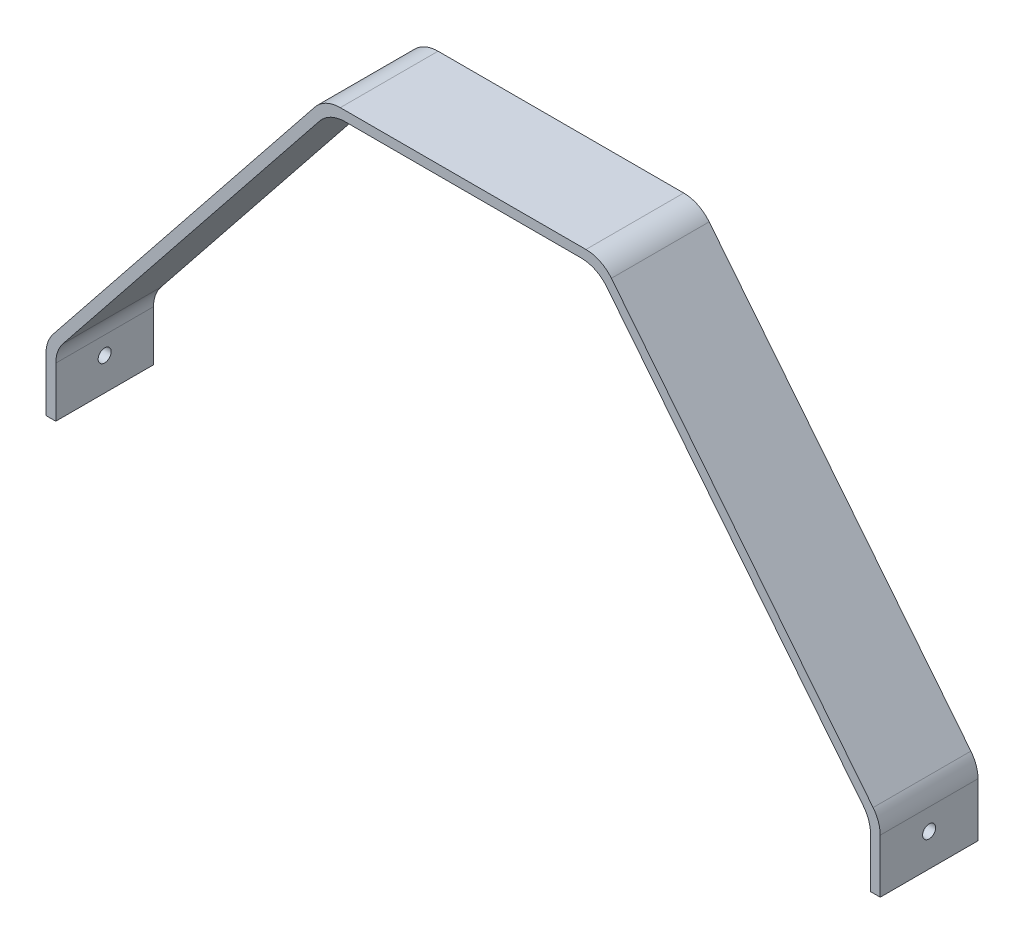
ISO-10303-21;
HEADER;
FILE_DESCRIPTION(('STEP AP214'),'2;1');
FILE_NAME('part.step','',(''),(''),'','','');
FILE_SCHEMA(('AUTOMOTIVE_DESIGN { 1 0 10303 214 1 1 1 1 }'));
ENDSEC;
DATA;
#1=APPLICATION_CONTEXT('core data for automotive mechanical design processes');
#2=APPLICATION_PROTOCOL_DEFINITION('international standard','automotive_design',2000,#1);
#3=PRODUCT_CONTEXT('',#1,'mechanical');
#4=PRODUCT('Part','Part','',(#3));
#5=PRODUCT_RELATED_PRODUCT_CATEGORY('part','',(#4));
#6=PRODUCT_DEFINITION_FORMATION('','',#4);
#7=PRODUCT_DEFINITION_CONTEXT('part definition',#1,'design');
#8=PRODUCT_DEFINITION('design','',#6,#7);
#9=PRODUCT_DEFINITION_SHAPE('','',#8);
#10=(LENGTH_UNIT() NAMED_UNIT(*) SI_UNIT(.MILLI.,.METRE.));
#11=(NAMED_UNIT(*) PLANE_ANGLE_UNIT() SI_UNIT($,.RADIAN.));
#12=(NAMED_UNIT(*) SI_UNIT($,.STERADIAN.) SOLID_ANGLE_UNIT());
#13=UNCERTAINTY_MEASURE_WITH_UNIT(LENGTH_MEASURE(1.E-05),#10,'distance_accuracy_value','');
#14=(GEOMETRIC_REPRESENTATION_CONTEXT(3) GLOBAL_UNCERTAINTY_ASSIGNED_CONTEXT((#13)) GLOBAL_UNIT_ASSIGNED_CONTEXT((#10,
#11,#12)) REPRESENTATION_CONTEXT('',''));
#15=CARTESIAN_POINT('',(0.,0.,0.));
#16=DIRECTION('',(0.,0.,1.));
#17=DIRECTION('',(1.,0.,0.));
#18=AXIS2_PLACEMENT_3D('',#15,#16,#17);
#19=CARTESIAN_POINT('',(0.,-127.,30.));
#20=DIRECTION('',(0.,-1.,0.));
#21=DIRECTION('',(0.,0.,-1.));
#22=AXIS2_PLACEMENT_3D('',#19,#20,#21);
#23=PLANE('',#22);
#24=DIRECTION('',(-1.,0.,0.));
#25=VECTOR('',#24,1.);
#26=CARTESIAN_POINT('',(0.,-127.,0.));
#27=LINE('',#26,#25);
#28=CARTESIAN_POINT('',(128.,-127.,0.));
#29=VERTEX_POINT('',#28);
#30=CARTESIAN_POINT('',(125.,-127.,0.));
#31=VERTEX_POINT('',#30);
#32=EDGE_CURVE('E191',#29,#31,#27,.T.);
#33=ORIENTED_EDGE('',*,*,#32,.F.);
#34=DIRECTION('',(0.,0.,-1.));
#35=VECTOR('',#34,1.);
#36=CARTESIAN_POINT('',(128.,-127.,30.));
#37=LINE('',#36,#35);
#38=CARTESIAN_POINT('',(128.,-127.,30.));
#39=VERTEX_POINT('',#38);
#40=EDGE_CURVE('E185',#39,#29,#37,.T.);
#41=ORIENTED_EDGE('',*,*,#40,.F.);
#42=DIRECTION('',(-1.,0.,0.));
#43=VECTOR('',#42,1.);
#44=CARTESIAN_POINT('',(0.,-127.,30.));
#45=LINE('',#44,#43);
#46=CARTESIAN_POINT('',(125.,-127.,30.));
#47=VERTEX_POINT('',#46);
#48=EDGE_CURVE('E188',#39,#47,#45,.T.);
#49=ORIENTED_EDGE('',*,*,#48,.T.);
#50=DIRECTION('',(0.,0.,-1.));
#51=VECTOR('',#50,1.);
#52=CARTESIAN_POINT('',(125.,-127.,30.));
#53=LINE('',#52,#51);
#54=EDGE_CURVE('E257',#47,#31,#53,.T.);
#55=ORIENTED_EDGE('',*,*,#54,.T.);
#56=EDGE_LOOP('',(#33,#41,#49,#55));
#57=FACE_BOUND('',#56,.T.);
#58=ADVANCED_FACE('F45',(#57),#23,.T.);
#59=CARTESIAN_POINT('',(128.,1.77635683940025E-13,30.));
#60=DIRECTION('',(-1.,0.,0.));
#61=DIRECTION('',(0.,-1.,0.));
#62=AXIS2_PLACEMENT_3D('',#59,#60,#61);
#63=PLANE('',#62);
#64=CARTESIAN_POINT('',(128.,-117.,15.));
#65=DIRECTION('',(1.,0.,0.));
#66=DIRECTION('',(0.,0.,-1.));
#67=AXIS2_PLACEMENT_3D('',#64,#65,#66);
#68=CIRCLE('',#67,2.);
#69=CARTESIAN_POINT('',(128.,-117.,13.));
#70=VERTEX_POINT('',#69);
#71=EDGE_CURVE('E530',#70,#70,#68,.T.);
#72=ORIENTED_EDGE('',*,*,#71,.F.);
#73=EDGE_LOOP('',(#72));
#74=FACE_BOUND('',#73,.T.);
#75=DIRECTION('',(0.,1.,0.));
#76=VECTOR('',#75,1.);
#77=CARTESIAN_POINT('',(128.,1.77635683940025E-13,0.));
#78=LINE('',#77,#76);
#79=CARTESIAN_POINT('',(128.,-110.504609524674,0.));
#80=VERTEX_POINT('',#79);
#81=EDGE_CURVE('E260',#29,#80,#78,.T.);
#82=ORIENTED_EDGE('',*,*,#81,.T.);
#83=DIRECTION('',(0.,0.,-1.));
#84=VECTOR('',#83,1.);
#85=CARTESIAN_POINT('',(128.,-110.504609524674,30.));
#86=LINE('',#85,#84);
#87=CARTESIAN_POINT('',(128.,-110.504609524674,30.));
#88=VERTEX_POINT('',#87);
#89=EDGE_CURVE('E203',#80,#88,#86,.F.);
#90=ORIENTED_EDGE('',*,*,#89,.T.);
#91=DIRECTION('',(0.,1.,0.));
#92=VECTOR('',#91,1.);
#93=CARTESIAN_POINT('',(128.,1.77635683940025E-13,30.));
#94=LINE('',#93,#92);
#95=EDGE_CURVE('E200',#39,#88,#94,.T.);
#96=ORIENTED_EDGE('',*,*,#95,.F.);
#97=ORIENTED_EDGE('',*,*,#40,.T.);
#98=EDGE_LOOP('',(#82,#90,#96,#97));
#99=FACE_BOUND('',#98,.T.);
#100=ADVANCED_FACE('F201',(#74,#99),#63,.F.);
#101=CARTESIAN_POINT('',(25.9382704532431,20.7263749883391,30.));
#102=DIRECTION('',(0.78122483700831,0.624249752936547,0.));
#103=DIRECTION('',(-0.624249752936547,0.78122483700831,0.));
#104=AXIS2_PLACEMENT_3D('',#101,#102,#103);
#105=PLANE('',#104);
#106=DIRECTION('',(0.624249752936547,-0.78122483700831,0.));
#107=VECTOR('',#106,1.);
#108=CARTESIAN_POINT('',(25.9382704532431,20.7263749883391,0.));
#109=LINE('',#108,#107);
#110=CARTESIAN_POINT('',(45.5024902919556,-3.75750247063452,0.));
#111=VERTEX_POINT('',#110);
#112=CARTESIAN_POINT('',(125.812248370083,-104.262111995309,0.));
#113=VERTEX_POINT('',#112);
#114=EDGE_CURVE('E263',#111,#113,#109,.T.);
#115=ORIENTED_EDGE('',*,*,#114,.F.);
#116=DIRECTION('',(0.,0.,-1.));
#117=VECTOR('',#116,1.);
#118=CARTESIAN_POINT('',(45.5024902919556,-3.75750247063452,30.));
#119=LINE('',#118,#117);
#120=CARTESIAN_POINT('',(45.5024902919556,-3.75750247063452,30.));
#121=VERTEX_POINT('',#120);
#122=EDGE_CURVE('E376',#111,#121,#119,.F.);
#123=ORIENTED_EDGE('',*,*,#122,.T.);
#124=DIRECTION('',(0.624249752936547,-0.78122483700831,0.));
#125=VECTOR('',#124,1.);
#126=CARTESIAN_POINT('',(25.9382704532431,20.7263749883391,30.));
#127=LINE('',#126,#125);
#128=CARTESIAN_POINT('',(125.812248370083,-104.262111995309,30.));
#129=VERTEX_POINT('',#128);
#130=EDGE_CURVE('E206',#121,#129,#127,.T.);
#131=ORIENTED_EDGE('',*,*,#130,.T.);
#132=DIRECTION('',(0.,0.,-1.));
#133=VECTOR('',#132,1.);
#134=CARTESIAN_POINT('',(125.812248370083,-104.262111995309,0.));
#135=LINE('',#134,#133);
#136=EDGE_CURVE('E372',#129,#113,#135,.T.);
#137=ORIENTED_EDGE('',*,*,#136,.T.);
#138=EDGE_LOOP('',(#115,#123,#131,#137));
#139=FACE_BOUND('',#138,.T.);
#140=ADVANCED_FACE('F428',(#139),#105,.T.);
#141=CARTESIAN_POINT('',(0.,0.,30.));
#142=DIRECTION('',(0.,1.,0.));
#143=DIRECTION('',(-1.,0.,0.));
#144=AXIS2_PLACEMENT_3D('',#141,#142,#143);
#145=PLANE('',#144);
#146=DIRECTION('',(1.,0.,0.));
#147=VECTOR('',#146,1.);
#148=CARTESIAN_POINT('',(0.,0.,0.));
#149=LINE('',#148,#147);
#150=CARTESIAN_POINT('',(-37.6902419218725,0.,0.));
#151=VERTEX_POINT('',#150);
#152=CARTESIAN_POINT('',(37.6902419218725,0.,0.));
#153=VERTEX_POINT('',#152);
#154=EDGE_CURVE('E267',#151,#153,#149,.T.);
#155=ORIENTED_EDGE('',*,*,#154,.F.);
#156=DIRECTION('',(0.,0.,-1.));
#157=VECTOR('',#156,1.);
#158=CARTESIAN_POINT('',(-37.6902419218725,0.,30.));
#159=LINE('',#158,#157);
#160=CARTESIAN_POINT('',(-37.6902419218725,0.,30.));
#161=VERTEX_POINT('',#160);
#162=EDGE_CURVE('E69',#151,#161,#159,.F.);
#163=ORIENTED_EDGE('',*,*,#162,.T.);
#164=DIRECTION('',(1.,0.,0.));
#165=VECTOR('',#164,1.);
#166=CARTESIAN_POINT('',(0.,0.,30.));
#167=LINE('',#166,#165);
#168=CARTESIAN_POINT('',(37.6902419218725,0.,30.));
#169=VERTEX_POINT('',#168);
#170=EDGE_CURVE('E226',#161,#169,#167,.T.);
#171=ORIENTED_EDGE('',*,*,#170,.T.);
#172=DIRECTION('',(0.,0.,-1.));
#173=VECTOR('',#172,1.);
#174=CARTESIAN_POINT('',(37.6902419218725,0.,30.));
#175=LINE('',#174,#173);
#176=EDGE_CURVE('E366',#169,#153,#175,.T.);
#177=ORIENTED_EDGE('',*,*,#176,.T.);
#178=EDGE_LOOP('',(#155,#163,#171,#177));
#179=FACE_BOUND('',#178,.T.);
#180=ADVANCED_FACE('F433',(#179),#145,.T.);
#181=CARTESIAN_POINT('',(-25.9382704532431,20.7263749883391,30.));
#182=DIRECTION('',(0.78122483700831,-0.624249752936546,0.));
#183=DIRECTION('',(0.624249752936546,0.78122483700831,0.));
#184=AXIS2_PLACEMENT_3D('',#181,#182,#183);
#185=PLANE('',#184);
#186=DIRECTION('',(-0.624249752936546,-0.78122483700831,0.));
#187=VECTOR('',#186,1.);
#188=CARTESIAN_POINT('',(-25.9382704532431,20.7263749883391,0.));
#189=LINE('',#188,#187);
#190=CARTESIAN_POINT('',(-45.5024902919556,-3.75750247063454,0.));
#191=VERTEX_POINT('',#190);
#192=CARTESIAN_POINT('',(-125.812248370083,-104.262111995309,0.));
#193=VERTEX_POINT('',#192);
#194=EDGE_CURVE('E271',#191,#193,#189,.T.);
#195=ORIENTED_EDGE('',*,*,#194,.T.);
#196=DIRECTION('',(0.,0.,-1.));
#197=VECTOR('',#196,1.);
#198=CARTESIAN_POINT('',(-125.812248370083,-104.262111995309,30.));
#199=LINE('',#198,#197);
#200=CARTESIAN_POINT('',(-125.812248370083,-104.262111995309,30.));
#201=VERTEX_POINT('',#200);
#202=EDGE_CURVE('E352',#193,#201,#199,.F.);
#203=ORIENTED_EDGE('',*,*,#202,.T.);
#204=DIRECTION('',(-0.624249752936546,-0.78122483700831,0.));
#205=VECTOR('',#204,1.);
#206=CARTESIAN_POINT('',(-25.9382704532431,20.7263749883391,30.));
#207=LINE('',#206,#205);
#208=CARTESIAN_POINT('',(-45.5024902919556,-3.75750247063454,30.));
#209=VERTEX_POINT('',#208);
#210=EDGE_CURVE('E229',#209,#201,#207,.T.);
#211=ORIENTED_EDGE('',*,*,#210,.F.);
#212=DIRECTION('',(0.,0.,-1.));
#213=VECTOR('',#212,1.);
#214=CARTESIAN_POINT('',(-45.5024902919556,-3.75750247063453,0.));
#215=LINE('',#214,#213);
#216=EDGE_CURVE('E348',#209,#191,#215,.T.);
#217=ORIENTED_EDGE('',*,*,#216,.T.);
#218=EDGE_LOOP('',(#195,#203,#211,#217));
#219=FACE_BOUND('',#218,.T.);
#220=ADVANCED_FACE('F441',(#219),#185,.F.);
#221=CARTESIAN_POINT('',(-128.,1.77635683940025E-13,30.));
#222=DIRECTION('',(-1.,0.,0.));
#223=DIRECTION('',(0.,-1.,0.));
#224=AXIS2_PLACEMENT_3D('',#221,#222,#223);
#225=PLANE('',#224);
#226=CARTESIAN_POINT('',(-128.,-117.,15.));
#227=DIRECTION('',(1.,0.,0.));
#228=DIRECTION('',(0.,0.,-1.));
#229=AXIS2_PLACEMENT_3D('',#226,#227,#228);
#230=CIRCLE('',#229,2.);
#231=CARTESIAN_POINT('',(-128.,-117.,13.));
#232=VERTEX_POINT('',#231);
#233=EDGE_CURVE('E532',#232,#232,#230,.T.);
#234=ORIENTED_EDGE('',*,*,#233,.T.);
#235=EDGE_LOOP('',(#234));
#236=FACE_BOUND('',#235,.T.);
#237=DIRECTION('',(0.,1.,0.));
#238=VECTOR('',#237,1.);
#239=CARTESIAN_POINT('',(-128.,1.77635683940025E-13,30.));
#240=LINE('',#239,#238);
#241=CARTESIAN_POINT('',(-128.,-127.,30.));
#242=VERTEX_POINT('',#241);
#243=CARTESIAN_POINT('',(-128.,-110.504609524674,30.));
#244=VERTEX_POINT('',#243);
#245=EDGE_CURVE('E232',#242,#244,#240,.T.);
#246=ORIENTED_EDGE('',*,*,#245,.T.);
#247=DIRECTION('',(0.,0.,-1.));
#248=VECTOR('',#247,1.);
#249=CARTESIAN_POINT('',(-128.,-110.504609524674,0.));
#250=LINE('',#249,#248);
#251=CARTESIAN_POINT('',(-128.,-110.504609524674,0.));
#252=VERTEX_POINT('',#251);
#253=EDGE_CURVE('E332',#244,#252,#250,.T.);
#254=ORIENTED_EDGE('',*,*,#253,.T.);
#255=DIRECTION('',(0.,1.,0.));
#256=VECTOR('',#255,1.);
#257=CARTESIAN_POINT('',(-128.,1.77635683940025E-13,0.));
#258=LINE('',#257,#256);
#259=CARTESIAN_POINT('',(-128.,-127.,0.));
#260=VERTEX_POINT('',#259);
#261=EDGE_CURVE('E275',#260,#252,#258,.T.);
#262=ORIENTED_EDGE('',*,*,#261,.F.);
#263=DIRECTION('',(0.,0.,-1.));
#264=VECTOR('',#263,1.);
#265=CARTESIAN_POINT('',(-128.,-127.,30.));
#266=LINE('',#265,#264);
#267=EDGE_CURVE('E197',#242,#260,#266,.T.);
#268=ORIENTED_EDGE('',*,*,#267,.F.);
#269=EDGE_LOOP('',(#246,#254,#262,#268));
#270=FACE_BOUND('',#269,.T.);
#271=ADVANCED_FACE('F450',(#236,#270),#225,.T.);
#272=CARTESIAN_POINT('',(0.,-127.,30.));
#273=DIRECTION('',(0.,1.,0.));
#274=DIRECTION('',(0.,0.,1.));
#275=AXIS2_PLACEMENT_3D('',#272,#273,#274);
#276=PLANE('',#275);
#277=DIRECTION('',(1.,0.,0.));
#278=VECTOR('',#277,1.);
#279=CARTESIAN_POINT('',(0.,-127.,0.));
#280=LINE('',#279,#278);
#281=CARTESIAN_POINT('',(-125.,-127.,0.));
#282=VERTEX_POINT('',#281);
#283=EDGE_CURVE('E279',#260,#282,#280,.T.);
#284=ORIENTED_EDGE('',*,*,#283,.T.);
#285=DIRECTION('',(0.,0.,-1.));
#286=VECTOR('',#285,1.);
#287=CARTESIAN_POINT('',(-125.,-127.,30.));
#288=LINE('',#287,#286);
#289=CARTESIAN_POINT('',(-125.,-127.,30.));
#290=VERTEX_POINT('',#289);
#291=EDGE_CURVE('E299',#290,#282,#288,.T.);
#292=ORIENTED_EDGE('',*,*,#291,.F.);
#293=DIRECTION('',(1.,0.,0.));
#294=VECTOR('',#293,1.);
#295=CARTESIAN_POINT('',(0.,-127.,30.));
#296=LINE('',#295,#294);
#297=EDGE_CURVE('E236',#242,#290,#296,.T.);
#298=ORIENTED_EDGE('',*,*,#297,.F.);
#299=ORIENTED_EDGE('',*,*,#267,.T.);
#300=EDGE_LOOP('',(#284,#292,#298,#299));
#301=FACE_BOUND('',#300,.T.);
#302=ADVANCED_FACE('F455',(#301),#276,.F.);
#303=CARTESIAN_POINT('',(-125.,0.,30.));
#304=DIRECTION('',(-1.,0.,0.));
#305=DIRECTION('',(0.,0.,1.));
#306=AXIS2_PLACEMENT_3D('',#303,#304,#305);
#307=PLANE('',#306);
#308=CARTESIAN_POINT('',(-125.,-117.,15.));
#309=DIRECTION('',(-1.,0.,0.));
#310=DIRECTION('',(0.,0.,1.));
#311=AXIS2_PLACEMENT_3D('',#308,#309,#310);
#312=CIRCLE('',#311,2.);
#313=CARTESIAN_POINT('',(-125.,-117.,17.));
#314=VERTEX_POINT('',#313);
#315=EDGE_CURVE('E220',#314,#314,#312,.T.);
#316=ORIENTED_EDGE('',*,*,#315,.T.);
#317=EDGE_LOOP('',(#316));
#318=FACE_BOUND('',#317,.T.);
#319=DIRECTION('',(0.,1.,0.));
#320=VECTOR('',#319,1.);
#321=CARTESIAN_POINT('',(-125.,0.,0.));
#322=LINE('',#321,#320);
#323=CARTESIAN_POINT('',(-125.,-111.555992382076,0.));
#324=VERTEX_POINT('',#323);
#325=EDGE_CURVE('E282',#282,#324,#322,.T.);
#326=ORIENTED_EDGE('',*,*,#325,.T.);
#327=DIRECTION('',(0.,0.,-1.));
#328=VECTOR('',#327,1.);
#329=CARTESIAN_POINT('',(-125.,-111.555992382076,30.));
#330=LINE('',#329,#328);
#331=CARTESIAN_POINT('',(-125.,-111.555992382076,30.));
#332=VERTEX_POINT('',#331);
#333=EDGE_CURVE('E311',#324,#332,#330,.F.);
#334=ORIENTED_EDGE('',*,*,#333,.T.);
#335=DIRECTION('',(0.,1.,0.));
#336=VECTOR('',#335,1.);
#337=CARTESIAN_POINT('',(-125.,0.,30.));
#338=LINE('',#337,#336);
#339=EDGE_CURVE('E239',#290,#332,#338,.T.);
#340=ORIENTED_EDGE('',*,*,#339,.F.);
#341=ORIENTED_EDGE('',*,*,#291,.T.);
#342=EDGE_LOOP('',(#326,#334,#340,#341));
#343=FACE_BOUND('',#342,.T.);
#344=ADVANCED_FACE('F459',(#318,#343),#307,.F.);
#345=CARTESIAN_POINT('',(-23.5945959422182,18.8536257295295,30.));
#346=DIRECTION('',(0.78122483700831,-0.624249752936547,0.));
#347=DIRECTION('',(0.624249752936547,0.78122483700831,0.));
#348=AXIS2_PLACEMENT_3D('',#345,#346,#347);
#349=PLANE('',#348);
#350=DIRECTION('',(-0.624249752936547,-0.78122483700831,0.));
#351=VECTOR('',#350,1.);
#352=CARTESIAN_POINT('',(-23.5945959422182,18.8536257295295,30.));
#353=LINE('',#352,#351);
#354=CARTESIAN_POINT('',(-44.0595628685174,-6.75750247063453,30.));
#355=VERTEX_POINT('',#354);
#356=CARTESIAN_POINT('',(-122.812248370083,-105.313494852711,30.));
#357=VERTEX_POINT('',#356);
#358=EDGE_CURVE('E243',#355,#357,#353,.T.);
#359=ORIENTED_EDGE('',*,*,#358,.T.);
#360=DIRECTION('',(0.,0.,-1.));
#361=VECTOR('',#360,1.);
#362=CARTESIAN_POINT('',(-122.812248370083,-105.313494852711,30.));
#363=LINE('',#362,#361);
#364=CARTESIAN_POINT('',(-122.812248370083,-105.313494852711,0.));
#365=VERTEX_POINT('',#364);
#366=EDGE_CURVE('E307',#357,#365,#363,.T.);
#367=ORIENTED_EDGE('',*,*,#366,.T.);
#368=DIRECTION('',(-0.624249752936547,-0.78122483700831,0.));
#369=VECTOR('',#368,1.);
#370=CARTESIAN_POINT('',(-23.5945959422182,18.8536257295295,0.));
#371=LINE('',#370,#369);
#372=CARTESIAN_POINT('',(-44.0595628685174,-6.75750247063453,0.));
#373=VERTEX_POINT('',#372);
#374=EDGE_CURVE('E286',#373,#365,#371,.T.);
#375=ORIENTED_EDGE('',*,*,#374,.F.);
#376=DIRECTION('',(0.,0.,-1.));
#377=VECTOR('',#376,1.);
#378=CARTESIAN_POINT('',(-44.0595628685174,-6.75750247063453,30.));
#379=LINE('',#378,#377);
#380=EDGE_CURVE('E196',#373,#355,#379,.F.);
#381=ORIENTED_EDGE('',*,*,#380,.T.);
#382=EDGE_LOOP('',(#359,#367,#375,#381));
#383=FACE_BOUND('',#382,.T.);
#384=ADVANCED_FACE('F468',(#383),#349,.T.);
#385=CARTESIAN_POINT('',(0.,-3.,30.));
#386=DIRECTION('',(0.,1.,0.));
#387=DIRECTION('',(0.,0.,1.));
#388=AXIS2_PLACEMENT_3D('',#385,#386,#387);
#389=PLANE('',#388);
#390=DIRECTION('',(1.,0.,0.));
#391=VECTOR('',#390,1.);
#392=CARTESIAN_POINT('',(0.,-3.,30.));
#393=LINE('',#392,#391);
#394=CARTESIAN_POINT('',(-36.2473144984343,-3.,30.));
#395=VERTEX_POINT('',#394);
#396=CARTESIAN_POINT('',(36.2473144984343,-3.,30.));
#397=VERTEX_POINT('',#396);
#398=EDGE_CURVE('E247',#395,#397,#393,.T.);
#399=ORIENTED_EDGE('',*,*,#398,.F.);
#400=DIRECTION('',(0.,0.,-1.));
#401=VECTOR('',#400,1.);
#402=CARTESIAN_POINT('',(-36.2473144984343,-3.,30.));
#403=LINE('',#402,#401);
#404=CARTESIAN_POINT('',(-36.2473144984343,-3.,0.));
#405=VERTEX_POINT('',#404);
#406=EDGE_CURVE('E317',#395,#405,#403,.T.);
#407=ORIENTED_EDGE('',*,*,#406,.T.);
#408=DIRECTION('',(1.,0.,0.));
#409=VECTOR('',#408,1.);
#410=CARTESIAN_POINT('',(0.,-3.,0.));
#411=LINE('',#410,#409);
#412=CARTESIAN_POINT('',(36.2473144984343,-3.,0.));
#413=VERTEX_POINT('',#412);
#414=EDGE_CURVE('E290',#405,#413,#411,.T.);
#415=ORIENTED_EDGE('',*,*,#414,.T.);
#416=DIRECTION('',(0.,0.,-1.));
#417=VECTOR('',#416,1.);
#418=CARTESIAN_POINT('',(36.2473144984343,-3.,30.));
#419=LINE('',#418,#417);
#420=EDGE_CURVE('E314',#413,#397,#419,.F.);
#421=ORIENTED_EDGE('',*,*,#420,.T.);
#422=EDGE_LOOP('',(#399,#407,#415,#421));
#423=FACE_BOUND('',#422,.T.);
#424=ADVANCED_FACE('F409',(#423),#389,.F.);
#425=CARTESIAN_POINT('',(23.5945959422181,18.8536257295295,30.));
#426=DIRECTION('',(0.78122483700831,0.624249752936547,0.));
#427=DIRECTION('',(-0.624249752936547,0.78122483700831,0.));
#428=AXIS2_PLACEMENT_3D('',#425,#426,#427);
#429=PLANE('',#428);
#430=DIRECTION('',(0.624249752936547,-0.78122483700831,0.));
#431=VECTOR('',#430,1.);
#432=CARTESIAN_POINT('',(23.5945959422181,18.8536257295295,0.));
#433=LINE('',#432,#431);
#434=CARTESIAN_POINT('',(44.0595628685174,-6.75750247063454,0.));
#435=VERTEX_POINT('',#434);
#436=CARTESIAN_POINT('',(122.812248370083,-105.313494852711,0.));
#437=VERTEX_POINT('',#436);
#438=EDGE_CURVE('E217',#435,#437,#433,.T.);
#439=ORIENTED_EDGE('',*,*,#438,.T.);
#440=DIRECTION('',(0.,0.,-1.));
#441=VECTOR('',#440,1.);
#442=CARTESIAN_POINT('',(122.812248370083,-105.313494852711,30.));
#443=LINE('',#442,#441);
#444=CARTESIAN_POINT('',(122.812248370083,-105.313494852711,30.));
#445=VERTEX_POINT('',#444);
#446=EDGE_CURVE('E329',#437,#445,#443,.F.);
#447=ORIENTED_EDGE('',*,*,#446,.T.);
#448=DIRECTION('',(0.624249752936547,-0.78122483700831,0.));
#449=VECTOR('',#448,1.);
#450=CARTESIAN_POINT('',(23.5945959422181,18.8536257295295,30.));
#451=LINE('',#450,#449);
#452=CARTESIAN_POINT('',(44.0595628685174,-6.75750247063454,30.));
#453=VERTEX_POINT('',#452);
#454=EDGE_CURVE('E251',#453,#445,#451,.T.);
#455=ORIENTED_EDGE('',*,*,#454,.F.);
#456=DIRECTION('',(0.,0.,-1.));
#457=VECTOR('',#456,1.);
#458=CARTESIAN_POINT('',(44.0595628685174,-6.75750247063453,0.));
#459=LINE('',#458,#457);
#460=EDGE_CURVE('E325',#453,#435,#459,.T.);
#461=ORIENTED_EDGE('',*,*,#460,.T.);
#462=EDGE_LOOP('',(#439,#447,#455,#461));
#463=FACE_BOUND('',#462,.T.);
#464=ADVANCED_FACE('F416',(#463),#429,.F.);
#465=CARTESIAN_POINT('',(125.,0.,30.));
#466=DIRECTION('',(-1.,0.,0.));
#467=DIRECTION('',(0.,0.,1.));
#468=AXIS2_PLACEMENT_3D('',#465,#466,#467);
#469=PLANE('',#468);
#470=CARTESIAN_POINT('',(125.,-117.,15.));
#471=DIRECTION('',(-1.,0.,0.));
#472=DIRECTION('',(0.,0.,1.));
#473=AXIS2_PLACEMENT_3D('',#470,#471,#472);
#474=CIRCLE('',#473,2.);
#475=CARTESIAN_POINT('',(125.,-117.,17.));
#476=VERTEX_POINT('',#475);
#477=EDGE_CURVE('E49',#476,#476,#474,.T.);
#478=ORIENTED_EDGE('',*,*,#477,.F.);
#479=EDGE_LOOP('',(#478));
#480=FACE_BOUND('',#479,.T.);
#481=DIRECTION('',(0.,1.,0.));
#482=VECTOR('',#481,1.);
#483=CARTESIAN_POINT('',(125.,0.,30.));
#484=LINE('',#483,#482);
#485=CARTESIAN_POINT('',(125.,-111.555992382076,30.));
#486=VERTEX_POINT('',#485);
#487=EDGE_CURVE('E211',#47,#486,#484,.T.);
#488=ORIENTED_EDGE('',*,*,#487,.T.);
#489=DIRECTION('',(0.,0.,-1.));
#490=VECTOR('',#489,1.);
#491=CARTESIAN_POINT('',(125.,-111.555992382076,30.));
#492=LINE('',#491,#490);
#493=CARTESIAN_POINT('',(125.,-111.555992382076,0.));
#494=VERTEX_POINT('',#493);
#495=EDGE_CURVE('E321',#486,#494,#492,.T.);
#496=ORIENTED_EDGE('',*,*,#495,.T.);
#497=DIRECTION('',(0.,1.,0.));
#498=VECTOR('',#497,1.);
#499=CARTESIAN_POINT('',(125.,0.,0.));
#500=LINE('',#499,#498);
#501=EDGE_CURVE('E213',#31,#494,#500,.T.);
#502=ORIENTED_EDGE('',*,*,#501,.F.);
#503=ORIENTED_EDGE('',*,*,#54,.F.);
#504=EDGE_LOOP('',(#488,#496,#502,#503));
#505=FACE_BOUND('',#504,.T.);
#506=ADVANCED_FACE('F422',(#480,#505),#469,.T.);
#507=CARTESIAN_POINT('',(0.,0.,30.));
#508=DIRECTION('',(0.,0.,1.));
#509=DIRECTION('',(1.,0.,0.));
#510=AXIS2_PLACEMENT_3D('',#507,#508,#509);
#511=PLANE('',#510);
#512=ORIENTED_EDGE('',*,*,#210,.T.);
#513=CARTESIAN_POINT('',(-118.,-110.504609524674,30.));
#514=DIRECTION('',(0.,0.,1.));
#515=DIRECTION('',(1.,0.,0.));
#516=AXIS2_PLACEMENT_3D('',#513,#514,#515);
#517=CIRCLE('',#516,10.);
#518=EDGE_CURVE('E363',#201,#244,#517,.T.);
#519=ORIENTED_EDGE('',*,*,#518,.T.);
#520=ORIENTED_EDGE('',*,*,#245,.F.);
#521=ORIENTED_EDGE('',*,*,#297,.T.);
#522=ORIENTED_EDGE('',*,*,#339,.T.);
#523=CARTESIAN_POINT('',(-115.,-111.555992382076,30.));
#524=DIRECTION('',(0.,0.,1.));
#525=DIRECTION('',(1.,0.,0.));
#526=AXIS2_PLACEMENT_3D('',#523,#524,#525);
#527=CIRCLE('',#526,10.);
#528=EDGE_CURVE('E384',#332,#357,#527,.F.);
#529=ORIENTED_EDGE('',*,*,#528,.T.);
#530=ORIENTED_EDGE('',*,*,#358,.F.);
#531=CARTESIAN_POINT('',(-36.2473144984343,-13.,30.));
#532=DIRECTION('',(0.,0.,1.));
#533=DIRECTION('',(1.,0.,0.));
#534=AXIS2_PLACEMENT_3D('',#531,#532,#533);
#535=CIRCLE('',#534,10.);
#536=EDGE_CURVE('E390',#355,#395,#535,.F.);
#537=ORIENTED_EDGE('',*,*,#536,.T.);
#538=ORIENTED_EDGE('',*,*,#398,.T.);
#539=CARTESIAN_POINT('',(36.2473144984343,-13.,30.));
#540=DIRECTION('',(0.,0.,1.));
#541=DIRECTION('',(1.,0.,0.));
#542=AXIS2_PLACEMENT_3D('',#539,#540,#541);
#543=CIRCLE('',#542,10.);
#544=EDGE_CURVE('E11',#397,#453,#543,.F.);
#545=ORIENTED_EDGE('',*,*,#544,.T.);
#546=ORIENTED_EDGE('',*,*,#454,.T.);
#547=CARTESIAN_POINT('',(115.,-111.555992382076,30.));
#548=DIRECTION('',(0.,0.,1.));
#549=DIRECTION('',(1.,0.,0.));
#550=AXIS2_PLACEMENT_3D('',#547,#548,#549);
#551=CIRCLE('',#550,10.);
#552=EDGE_CURVE('E396',#445,#486,#551,.F.);
#553=ORIENTED_EDGE('',*,*,#552,.T.);
#554=ORIENTED_EDGE('',*,*,#487,.F.);
#555=ORIENTED_EDGE('',*,*,#48,.F.);
#556=ORIENTED_EDGE('',*,*,#95,.T.);
#557=CARTESIAN_POINT('',(118.,-110.504609524674,30.));
#558=DIRECTION('',(0.,0.,1.));
#559=DIRECTION('',(1.,0.,0.));
#560=AXIS2_PLACEMENT_3D('',#557,#558,#559);
#561=CIRCLE('',#560,10.);
#562=EDGE_CURVE('E355',#88,#129,#561,.T.);
#563=ORIENTED_EDGE('',*,*,#562,.T.);
#564=ORIENTED_EDGE('',*,*,#130,.F.);
#565=CARTESIAN_POINT('',(37.6902419218725,-9.99999999999998,30.));
#566=DIRECTION('',(0.,0.,1.));
#567=DIRECTION('',(1.,0.,0.));
#568=AXIS2_PLACEMENT_3D('',#565,#566,#567);
#569=CIRCLE('',#568,10.);
#570=EDGE_CURVE('E62',#121,#169,#569,.T.);
#571=ORIENTED_EDGE('',*,*,#570,.T.);
#572=ORIENTED_EDGE('',*,*,#170,.F.);
#573=CARTESIAN_POINT('',(-37.6902419218725,-10.,30.));
#574=DIRECTION('',(0.,0.,1.));
#575=DIRECTION('',(1.,0.,0.));
#576=AXIS2_PLACEMENT_3D('',#573,#574,#575);
#577=CIRCLE('',#576,10.);
#578=EDGE_CURVE('E360',#161,#209,#577,.T.);
#579=ORIENTED_EDGE('',*,*,#578,.T.);
#580=EDGE_LOOP('',(#512,#519,#520,#521,#522,#529,#530,#537,#538,#545,#546,#553,#554,#555,#556,
#563,#564,#571,#572,#579));
#581=FACE_BOUND('',#580,.T.);
#582=ADVANCED_FACE('F209',(#581),#511,.T.);
#583=CARTESIAN_POINT('',(0.,0.,0.));
#584=DIRECTION('',(0.,0.,1.));
#585=DIRECTION('',(1.,0.,0.));
#586=AXIS2_PLACEMENT_3D('',#583,#584,#585);
#587=PLANE('',#586);
#588=ORIENTED_EDGE('',*,*,#261,.T.);
#589=CARTESIAN_POINT('',(-118.,-110.504609524674,0.));
#590=DIRECTION('',(0.,0.,1.));
#591=DIRECTION('',(1.,0.,0.));
#592=AXIS2_PLACEMENT_3D('',#589,#590,#591);
#593=CIRCLE('',#592,10.);
#594=EDGE_CURVE('E345',#252,#193,#593,.F.);
#595=ORIENTED_EDGE('',*,*,#594,.T.);
#596=ORIENTED_EDGE('',*,*,#194,.F.);
#597=CARTESIAN_POINT('',(-37.6902419218725,-10.,0.));
#598=DIRECTION('',(0.,0.,1.));
#599=DIRECTION('',(1.,0.,0.));
#600=AXIS2_PLACEMENT_3D('',#597,#598,#599);
#601=CIRCLE('',#600,10.);
#602=EDGE_CURVE('E342',#191,#151,#601,.F.);
#603=ORIENTED_EDGE('',*,*,#602,.T.);
#604=ORIENTED_EDGE('',*,*,#154,.T.);
#605=CARTESIAN_POINT('',(37.6902419218725,-9.99999999999998,0.));
#606=DIRECTION('',(0.,0.,1.));
#607=DIRECTION('',(1.,0.,0.));
#608=AXIS2_PLACEMENT_3D('',#605,#606,#607);
#609=CIRCLE('',#608,10.);
#610=EDGE_CURVE('E339',#153,#111,#609,.F.);
#611=ORIENTED_EDGE('',*,*,#610,.T.);
#612=ORIENTED_EDGE('',*,*,#114,.T.);
#613=CARTESIAN_POINT('',(118.,-110.504609524674,0.));
#614=DIRECTION('',(0.,0.,1.));
#615=DIRECTION('',(1.,0.,0.));
#616=AXIS2_PLACEMENT_3D('',#613,#614,#615);
#617=CIRCLE('',#616,10.);
#618=EDGE_CURVE('E336',#113,#80,#617,.F.);
#619=ORIENTED_EDGE('',*,*,#618,.T.);
#620=ORIENTED_EDGE('',*,*,#81,.F.);
#621=ORIENTED_EDGE('',*,*,#32,.T.);
#622=ORIENTED_EDGE('',*,*,#501,.T.);
#623=CARTESIAN_POINT('',(115.,-111.555992382076,0.));
#624=DIRECTION('',(0.,0.,1.));
#625=DIRECTION('',(1.,0.,0.));
#626=AXIS2_PLACEMENT_3D('',#623,#624,#625);
#627=CIRCLE('',#626,10.);
#628=EDGE_CURVE('E393',#494,#437,#627,.T.);
#629=ORIENTED_EDGE('',*,*,#628,.T.);
#630=ORIENTED_EDGE('',*,*,#438,.F.);
#631=CARTESIAN_POINT('',(36.2473144984343,-13.,0.));
#632=DIRECTION('',(0.,0.,1.));
#633=DIRECTION('',(1.,0.,0.));
#634=AXIS2_PLACEMENT_3D('',#631,#632,#633);
#635=CIRCLE('',#634,10.);
#636=EDGE_CURVE('E55',#435,#413,#635,.T.);
#637=ORIENTED_EDGE('',*,*,#636,.T.);
#638=ORIENTED_EDGE('',*,*,#414,.F.);
#639=CARTESIAN_POINT('',(-36.2473144984343,-13.,0.));
#640=DIRECTION('',(0.,0.,1.));
#641=DIRECTION('',(1.,0.,0.));
#642=AXIS2_PLACEMENT_3D('',#639,#640,#641);
#643=CIRCLE('',#642,10.);
#644=EDGE_CURVE('E387',#405,#373,#643,.T.);
#645=ORIENTED_EDGE('',*,*,#644,.T.);
#646=ORIENTED_EDGE('',*,*,#374,.T.);
#647=CARTESIAN_POINT('',(-115.,-111.555992382076,0.));
#648=DIRECTION('',(0.,0.,1.));
#649=DIRECTION('',(1.,0.,0.));
#650=AXIS2_PLACEMENT_3D('',#647,#648,#649);
#651=CIRCLE('',#650,10.);
#652=EDGE_CURVE('E381',#365,#324,#651,.T.);
#653=ORIENTED_EDGE('',*,*,#652,.T.);
#654=ORIENTED_EDGE('',*,*,#325,.F.);
#655=ORIENTED_EDGE('',*,*,#283,.F.);
#656=EDGE_LOOP('',(#588,#595,#596,#603,#604,#611,#612,#619,#620,#621,#622,#629,#630,#637,#638,
#645,#646,#653,#654,#655));
#657=FACE_BOUND('',#656,.T.);
#658=ADVANCED_FACE('F403',(#657),#587,.F.);
#659=CARTESIAN_POINT('',(-115.,-111.555992382076,30.));
#660=DIRECTION('',(0.,0.,-1.));
#661=DIRECTION('',(-1.,0.,0.));
#662=AXIS2_PLACEMENT_3D('',#659,#660,#661);
#663=CYLINDRICAL_SURFACE('',#662,10.);
#664=ORIENTED_EDGE('',*,*,#528,.F.);
#665=ORIENTED_EDGE('',*,*,#333,.F.);
#666=ORIENTED_EDGE('',*,*,#652,.F.);
#667=ORIENTED_EDGE('',*,*,#366,.F.);
#668=EDGE_LOOP('',(#664,#665,#666,#667));
#669=FACE_BOUND('',#668,.T.);
#670=ADVANCED_FACE('F465',(#669),#663,.F.);
#671=CARTESIAN_POINT('',(-36.2473144984343,-13.,30.));
#672=DIRECTION('',(0.,0.,-1.));
#673=DIRECTION('',(-1.,0.,0.));
#674=AXIS2_PLACEMENT_3D('',#671,#672,#673);
#675=CYLINDRICAL_SURFACE('',#674,10.);
#676=ORIENTED_EDGE('',*,*,#536,.F.);
#677=ORIENTED_EDGE('',*,*,#380,.F.);
#678=ORIENTED_EDGE('',*,*,#644,.F.);
#679=ORIENTED_EDGE('',*,*,#406,.F.);
#680=EDGE_LOOP('',(#676,#677,#678,#679));
#681=FACE_BOUND('',#680,.T.);
#682=ADVANCED_FACE('F472',(#681),#675,.F.);
#683=CARTESIAN_POINT('',(115.,-111.555992382076,30.));
#684=DIRECTION('',(0.,0.,-1.));
#685=DIRECTION('',(-1.,0.,0.));
#686=AXIS2_PLACEMENT_3D('',#683,#684,#685);
#687=CYLINDRICAL_SURFACE('',#686,10.);
#688=ORIENTED_EDGE('',*,*,#552,.F.);
#689=ORIENTED_EDGE('',*,*,#446,.F.);
#690=ORIENTED_EDGE('',*,*,#628,.F.);
#691=ORIENTED_EDGE('',*,*,#495,.F.);
#692=EDGE_LOOP('',(#688,#689,#690,#691));
#693=FACE_BOUND('',#692,.T.);
#694=ADVANCED_FACE('F419',(#693),#687,.F.);
#695=CARTESIAN_POINT('',(36.2473144984343,-13.,30.));
#696=DIRECTION('',(0.,0.,1.));
#697=DIRECTION('',(1.,0.,0.));
#698=AXIS2_PLACEMENT_3D('',#695,#696,#697);
#699=CYLINDRICAL_SURFACE('',#698,10.);
#700=ORIENTED_EDGE('',*,*,#544,.F.);
#701=ORIENTED_EDGE('',*,*,#420,.F.);
#702=ORIENTED_EDGE('',*,*,#636,.F.);
#703=ORIENTED_EDGE('',*,*,#460,.F.);
#704=EDGE_LOOP('',(#700,#701,#702,#703));
#705=FACE_BOUND('',#704,.T.);
#706=ADVANCED_FACE('F412',(#705),#699,.F.);
#707=CARTESIAN_POINT('',(-118.,-110.504609524674,30.));
#708=DIRECTION('',(0.,0.,1.));
#709=DIRECTION('',(1.,0.,0.));
#710=AXIS2_PLACEMENT_3D('',#707,#708,#709);
#711=CYLINDRICAL_SURFACE('',#710,10.);
#712=ORIENTED_EDGE('',*,*,#518,.F.);
#713=ORIENTED_EDGE('',*,*,#202,.F.);
#714=ORIENTED_EDGE('',*,*,#594,.F.);
#715=ORIENTED_EDGE('',*,*,#253,.F.);
#716=EDGE_LOOP('',(#712,#713,#714,#715));
#717=FACE_BOUND('',#716,.T.);
#718=ADVANCED_FACE('F447',(#717),#711,.T.);
#719=CARTESIAN_POINT('',(-37.6902419218725,-10.,30.));
#720=DIRECTION('',(0.,0.,1.));
#721=DIRECTION('',(1.,0.,0.));
#722=AXIS2_PLACEMENT_3D('',#719,#720,#721);
#723=CYLINDRICAL_SURFACE('',#722,10.);
#724=ORIENTED_EDGE('',*,*,#578,.F.);
#725=ORIENTED_EDGE('',*,*,#162,.F.);
#726=ORIENTED_EDGE('',*,*,#602,.F.);
#727=ORIENTED_EDGE('',*,*,#216,.F.);
#728=EDGE_LOOP('',(#724,#725,#726,#727));
#729=FACE_BOUND('',#728,.T.);
#730=ADVANCED_FACE('F438',(#729),#723,.T.);
#731=CARTESIAN_POINT('',(37.6902419218725,-9.99999999999998,30.));
#732=DIRECTION('',(0.,0.,-1.));
#733=DIRECTION('',(-1.,0.,0.));
#734=AXIS2_PLACEMENT_3D('',#731,#732,#733);
#735=CYLINDRICAL_SURFACE('',#734,10.);
#736=ORIENTED_EDGE('',*,*,#570,.F.);
#737=ORIENTED_EDGE('',*,*,#122,.F.);
#738=ORIENTED_EDGE('',*,*,#610,.F.);
#739=ORIENTED_EDGE('',*,*,#176,.F.);
#740=EDGE_LOOP('',(#736,#737,#738,#739));
#741=FACE_BOUND('',#740,.T.);
#742=ADVANCED_FACE('F431',(#741),#735,.T.);
#743=CARTESIAN_POINT('',(118.,-110.504609524674,30.));
#744=DIRECTION('',(0.,0.,1.));
#745=DIRECTION('',(1.,0.,0.));
#746=AXIS2_PLACEMENT_3D('',#743,#744,#745);
#747=CYLINDRICAL_SURFACE('',#746,10.);
#748=ORIENTED_EDGE('',*,*,#562,.F.);
#749=ORIENTED_EDGE('',*,*,#89,.F.);
#750=ORIENTED_EDGE('',*,*,#618,.F.);
#751=ORIENTED_EDGE('',*,*,#136,.F.);
#752=EDGE_LOOP('',(#748,#749,#750,#751));
#753=FACE_BOUND('',#752,.T.);
#754=ADVANCED_FACE('F47',(#753),#747,.T.);
#755=CARTESIAN_POINT('',(-128.,-117.,15.));
#756=DIRECTION('',(1.,0.,0.));
#757=DIRECTION('',(0.,0.,-1.));
#758=AXIS2_PLACEMENT_3D('',#755,#756,#757);
#759=CYLINDRICAL_SURFACE('',#758,2.);
#760=ORIENTED_EDGE('',*,*,#477,.T.);
#761=EDGE_LOOP('',(#760));
#762=FACE_BOUND('',#761,.T.);
#763=ORIENTED_EDGE('',*,*,#71,.T.);
#764=EDGE_LOOP('',(#763));
#765=FACE_BOUND('',#764,.T.);
#766=ADVANCED_FACE('F516',(#762,#765),#759,.F.);
#767=ORIENTED_EDGE('',*,*,#233,.F.);
#768=EDGE_LOOP('',(#767));
#769=FACE_BOUND('',#768,.T.);
#770=ORIENTED_EDGE('',*,*,#315,.F.);
#771=EDGE_LOOP('',(#770));
#772=FACE_BOUND('',#771,.T.);
#773=ADVANCED_FACE('F518',(#769,#772),#759,.F.);
#774=CLOSED_SHELL('',(#58,#100,#140,#180,#220,#271,#302,#344,#384,#424,#464,#506,#582,#658,#670,
#682,#694,#706,#718,#730,#742,#754,#766,#773));
#775=MANIFOLD_SOLID_BREP('B2',#774);
#776=ADVANCED_BREP_SHAPE_REPRESENTATION('',(#18,#775),#14);
#777=SHAPE_DEFINITION_REPRESENTATION(#9,#776);
ENDSEC;
END-ISO-10303-21;
